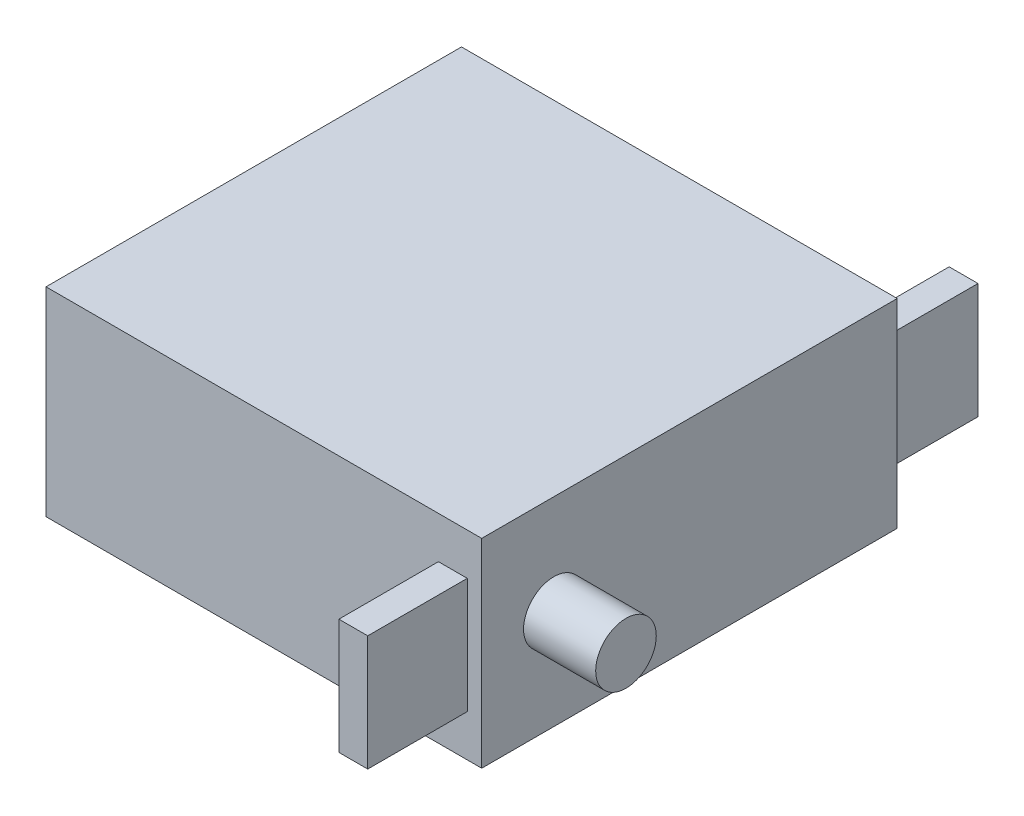
ISO-10303-21;
HEADER;
FILE_DESCRIPTION(('STEP AP214'),'2;1');
FILE_NAME('part.step','',(''),(''),'','','');
FILE_SCHEMA(('AUTOMOTIVE_DESIGN { 1 0 10303 214 1 1 1 1 }'));
ENDSEC;
DATA;
#1=APPLICATION_CONTEXT('core data for automotive mechanical design processes');
#2=APPLICATION_PROTOCOL_DEFINITION('international standard','automotive_design',2000,#1);
#3=PRODUCT_CONTEXT('',#1,'mechanical');
#4=PRODUCT('Part','Part','',(#3));
#5=PRODUCT_RELATED_PRODUCT_CATEGORY('part','',(#4));
#6=PRODUCT_DEFINITION_FORMATION('','',#4);
#7=PRODUCT_DEFINITION_CONTEXT('part definition',#1,'design');
#8=PRODUCT_DEFINITION('design','',#6,#7);
#9=PRODUCT_DEFINITION_SHAPE('','',#8);
#10=(LENGTH_UNIT() NAMED_UNIT(*) SI_UNIT(.MILLI.,.METRE.));
#11=(NAMED_UNIT(*) PLANE_ANGLE_UNIT() SI_UNIT($,.RADIAN.));
#12=(NAMED_UNIT(*) SI_UNIT($,.STERADIAN.) SOLID_ANGLE_UNIT());
#13=UNCERTAINTY_MEASURE_WITH_UNIT(LENGTH_MEASURE(1.E-05),#10,'distance_accuracy_value','');
#14=(GEOMETRIC_REPRESENTATION_CONTEXT(3) GLOBAL_UNCERTAINTY_ASSIGNED_CONTEXT((#13)) GLOBAL_UNIT_ASSIGNED_CONTEXT((#10,
#11,#12)) REPRESENTATION_CONTEXT('',''));
#15=CARTESIAN_POINT('',(0.,0.,0.));
#16=DIRECTION('',(0.,0.,1.));
#17=DIRECTION('',(1.,0.,0.));
#18=AXIS2_PLACEMENT_3D('',#15,#16,#17);
#19=CARTESIAN_POINT('',(0.,6.9,-28.8));
#20=DIRECTION('',(0.,0.,1.));
#21=DIRECTION('',(1.,0.,0.));
#22=AXIS2_PLACEMENT_3D('',#19,#20,#21);
#23=PLANE('',#22);
#24=DIRECTION('',(-1.,0.,0.));
#25=VECTOR('',#24,1.);
#26=CARTESIAN_POINT('',(0.,-6.9,-28.8));
#27=LINE('',#26,#25);
#28=CARTESIAN_POINT('',(30.2,-6.9,-28.8));
#29=VERTEX_POINT('',#28);
#30=CARTESIAN_POINT('',(0.,-6.9,-28.8));
#31=VERTEX_POINT('',#30);
#32=EDGE_CURVE('E189',#29,#31,#27,.T.);
#33=ORIENTED_EDGE('',*,*,#32,.T.);
#34=DIRECTION('',(0.,-1.,0.));
#35=VECTOR('',#34,1.);
#36=CARTESIAN_POINT('',(0.,6.9,-28.8));
#37=LINE('',#36,#35);
#38=CARTESIAN_POINT('',(0.,6.9,-28.8));
#39=VERTEX_POINT('',#38);
#40=EDGE_CURVE('E195',#39,#31,#37,.T.);
#41=ORIENTED_EDGE('',*,*,#40,.F.);
#42=DIRECTION('',(-1.,0.,0.));
#43=VECTOR('',#42,1.);
#44=CARTESIAN_POINT('',(0.,6.9,-28.8));
#45=LINE('',#44,#43);
#46=CARTESIAN_POINT('',(30.2,6.9,-28.8));
#47=VERTEX_POINT('',#46);
#48=EDGE_CURVE('E193',#47,#39,#45,.T.);
#49=ORIENTED_EDGE('',*,*,#48,.F.);
#50=DIRECTION('',(0.,-1.,0.));
#51=VECTOR('',#50,1.);
#52=CARTESIAN_POINT('',(30.2,6.9,-28.8));
#53=LINE('',#52,#51);
#54=EDGE_CURVE('E205',#47,#29,#53,.T.);
#55=ORIENTED_EDGE('',*,*,#54,.T.);
#56=EDGE_LOOP('',(#33,#41,#49,#55));
#57=FACE_BOUND('',#56,.T.);
#58=DIRECTION('',(1.,0.,0.));
#59=VECTOR('',#58,1.);
#60=CARTESIAN_POINT('',(27.2,4.,-28.8));
#61=LINE('',#60,#59);
#62=CARTESIAN_POINT('',(27.2,4.,-28.8));
#63=VERTEX_POINT('',#62);
#64=CARTESIAN_POINT('',(29.2,4.,-28.8));
#65=VERTEX_POINT('',#64);
#66=EDGE_CURVE('E142',#63,#65,#61,.T.);
#67=ORIENTED_EDGE('',*,*,#66,.F.);
#68=DIRECTION('',(0.,1.,0.));
#69=VECTOR('',#68,1.);
#70=CARTESIAN_POINT('',(27.2,-4.,-28.8));
#71=LINE('',#70,#69);
#72=CARTESIAN_POINT('',(27.2,-4.,-28.8));
#73=VERTEX_POINT('',#72);
#74=EDGE_CURVE('E139',#73,#63,#71,.T.);
#75=ORIENTED_EDGE('',*,*,#74,.F.);
#76=DIRECTION('',(-1.,0.,0.));
#77=VECTOR('',#76,1.);
#78=CARTESIAN_POINT('',(29.2,-4.,-28.8));
#79=LINE('',#78,#77);
#80=CARTESIAN_POINT('',(29.2,-4.,-28.8));
#81=VERTEX_POINT('',#80);
#82=EDGE_CURVE('E53',#81,#73,#79,.T.);
#83=ORIENTED_EDGE('',*,*,#82,.F.);
#84=DIRECTION('',(0.,-1.,0.));
#85=VECTOR('',#84,1.);
#86=CARTESIAN_POINT('',(29.2,4.,-28.8));
#87=LINE('',#86,#85);
#88=EDGE_CURVE('E48',#65,#81,#87,.T.);
#89=ORIENTED_EDGE('',*,*,#88,.F.);
#90=EDGE_LOOP('',(#67,#75,#83,#89));
#91=FACE_BOUND('',#90,.T.);
#92=ADVANCED_FACE('F33',(#57,#91),#23,.F.);
#93=CARTESIAN_POINT('',(0.,6.9,0.));
#94=DIRECTION('',(0.,0.,-1.));
#95=DIRECTION('',(-1.,0.,0.));
#96=AXIS2_PLACEMENT_3D('',#93,#94,#95);
#97=PLANE('',#96);
#98=DIRECTION('',(1.,0.,0.));
#99=VECTOR('',#98,1.);
#100=CARTESIAN_POINT('',(0.,-6.9,0.));
#101=LINE('',#100,#99);
#102=CARTESIAN_POINT('',(0.,-6.9,0.));
#103=VERTEX_POINT('',#102);
#104=CARTESIAN_POINT('',(30.2,-6.9,0.));
#105=VERTEX_POINT('',#104);
#106=EDGE_CURVE('E198',#103,#105,#101,.T.);
#107=ORIENTED_EDGE('',*,*,#106,.T.);
#108=DIRECTION('',(0.,-1.,0.));
#109=VECTOR('',#108,1.);
#110=CARTESIAN_POINT('',(30.2,6.9,0.));
#111=LINE('',#110,#109);
#112=CARTESIAN_POINT('',(30.2,6.9,0.));
#113=VERTEX_POINT('',#112);
#114=EDGE_CURVE('E208',#113,#105,#111,.T.);
#115=ORIENTED_EDGE('',*,*,#114,.F.);
#116=DIRECTION('',(1.,0.,0.));
#117=VECTOR('',#116,1.);
#118=CARTESIAN_POINT('',(0.,6.9,0.));
#119=LINE('',#118,#117);
#120=CARTESIAN_POINT('',(0.,6.9,0.));
#121=VERTEX_POINT('',#120);
#122=EDGE_CURVE('E188',#121,#113,#119,.T.);
#123=ORIENTED_EDGE('',*,*,#122,.F.);
#124=DIRECTION('',(0.,-1.,0.));
#125=VECTOR('',#124,1.);
#126=CARTESIAN_POINT('',(0.,6.9,0.));
#127=LINE('',#126,#125);
#128=EDGE_CURVE('E41',#121,#103,#127,.T.);
#129=ORIENTED_EDGE('',*,*,#128,.T.);
#130=EDGE_LOOP('',(#107,#115,#123,#129));
#131=FACE_BOUND('',#130,.T.);
#132=DIRECTION('',(0.,-1.,0.));
#133=VECTOR('',#132,1.);
#134=CARTESIAN_POINT('',(27.2,4.,0.));
#135=LINE('',#134,#133);
#136=CARTESIAN_POINT('',(27.2,4.,0.));
#137=VERTEX_POINT('',#136);
#138=CARTESIAN_POINT('',(27.2,-4.,0.));
#139=VERTEX_POINT('',#138);
#140=EDGE_CURVE('E143',#137,#139,#135,.T.);
#141=ORIENTED_EDGE('',*,*,#140,.F.);
#142=DIRECTION('',(-1.,0.,0.));
#143=VECTOR('',#142,1.);
#144=CARTESIAN_POINT('',(27.2,4.,0.));
#145=LINE('',#144,#143);
#146=CARTESIAN_POINT('',(29.2,4.,0.));
#147=VERTEX_POINT('',#146);
#148=EDGE_CURVE('E156',#147,#137,#145,.T.);
#149=ORIENTED_EDGE('',*,*,#148,.F.);
#150=DIRECTION('',(0.,1.,0.));
#151=VECTOR('',#150,1.);
#152=CARTESIAN_POINT('',(29.2,4.,0.));
#153=LINE('',#152,#151);
#154=CARTESIAN_POINT('',(29.2,-4.,0.));
#155=VERTEX_POINT('',#154);
#156=EDGE_CURVE('E165',#155,#147,#153,.T.);
#157=ORIENTED_EDGE('',*,*,#156,.F.);
#158=DIRECTION('',(1.,0.,0.));
#159=VECTOR('',#158,1.);
#160=CARTESIAN_POINT('',(27.2,-4.,0.));
#161=LINE('',#160,#159);
#162=EDGE_CURVE('E146',#139,#155,#161,.T.);
#163=ORIENTED_EDGE('',*,*,#162,.F.);
#164=EDGE_LOOP('',(#141,#149,#157,#163));
#165=FACE_BOUND('',#164,.T.);
#166=ADVANCED_FACE('F213',(#131,#165),#97,.F.);
#167=CARTESIAN_POINT('',(0.,6.9,0.));
#168=DIRECTION('',(1.,0.,0.));
#169=DIRECTION('',(0.,0.,-1.));
#170=AXIS2_PLACEMENT_3D('',#167,#168,#169);
#171=PLANE('',#170);
#172=DIRECTION('',(0.,0.,1.));
#173=VECTOR('',#172,1.);
#174=CARTESIAN_POINT('',(0.,-6.9,0.));
#175=LINE('',#174,#173);
#176=EDGE_CURVE('E184',#31,#103,#175,.T.);
#177=ORIENTED_EDGE('',*,*,#176,.T.);
#178=ORIENTED_EDGE('',*,*,#128,.F.);
#179=DIRECTION('',(0.,0.,1.));
#180=VECTOR('',#179,1.);
#181=CARTESIAN_POINT('',(0.,6.9,0.));
#182=LINE('',#181,#180);
#183=EDGE_CURVE('E185',#39,#121,#182,.T.);
#184=ORIENTED_EDGE('',*,*,#183,.F.);
#185=ORIENTED_EDGE('',*,*,#40,.T.);
#186=EDGE_LOOP('',(#177,#178,#184,#185));
#187=FACE_BOUND('',#186,.T.);
#188=ADVANCED_FACE('F35',(#187),#171,.F.);
#189=CARTESIAN_POINT('',(30.2,6.9,0.));
#190=DIRECTION('',(-1.,0.,0.));
#191=DIRECTION('',(0.,0.,1.));
#192=AXIS2_PLACEMENT_3D('',#189,#190,#191);
#193=PLANE('',#192);
#194=CARTESIAN_POINT('',(30.2,0.,-5.));
#195=DIRECTION('',(-1.,0.,0.));
#196=DIRECTION('',(0.,0.,1.));
#197=AXIS2_PLACEMENT_3D('',#194,#195,#196);
#198=CIRCLE('',#197,2.1);
#199=CARTESIAN_POINT('',(30.2,0.,-2.9));
#200=VERTEX_POINT('',#199);
#201=EDGE_CURVE('E11',#200,#200,#198,.F.);
#202=ORIENTED_EDGE('',*,*,#201,.F.);
#203=EDGE_LOOP('',(#202));
#204=FACE_BOUND('',#203,.T.);
#205=DIRECTION('',(0.,0.,-1.));
#206=VECTOR('',#205,1.);
#207=CARTESIAN_POINT('',(30.2,-6.9,0.));
#208=LINE('',#207,#206);
#209=EDGE_CURVE('E200',#105,#29,#208,.T.);
#210=ORIENTED_EDGE('',*,*,#209,.T.);
#211=ORIENTED_EDGE('',*,*,#54,.F.);
#212=DIRECTION('',(0.,0.,-1.));
#213=VECTOR('',#212,1.);
#214=CARTESIAN_POINT('',(30.2,6.9,0.));
#215=LINE('',#214,#213);
#216=EDGE_CURVE('E191',#113,#47,#215,.T.);
#217=ORIENTED_EDGE('',*,*,#216,.F.);
#218=ORIENTED_EDGE('',*,*,#114,.T.);
#219=EDGE_LOOP('',(#210,#211,#217,#218));
#220=FACE_BOUND('',#219,.T.);
#221=ADVANCED_FACE('F226',(#204,#220),#193,.F.);
#222=CARTESIAN_POINT('',(0.,6.9,0.));
#223=DIRECTION('',(0.,-1.,0.));
#224=DIRECTION('',(0.,0.,-1.));
#225=AXIS2_PLACEMENT_3D('',#222,#223,#224);
#226=PLANE('',#225);
#227=ORIENTED_EDGE('',*,*,#183,.T.);
#228=ORIENTED_EDGE('',*,*,#122,.T.);
#229=ORIENTED_EDGE('',*,*,#216,.T.);
#230=ORIENTED_EDGE('',*,*,#48,.T.);
#231=EDGE_LOOP('',(#227,#228,#229,#230));
#232=FACE_BOUND('',#231,.T.);
#233=ADVANCED_FACE('F231',(#232),#226,.F.);
#234=CARTESIAN_POINT('',(0.,-6.9,0.));
#235=DIRECTION('',(0.,-1.,0.));
#236=DIRECTION('',(0.,0.,-1.));
#237=AXIS2_PLACEMENT_3D('',#234,#235,#236);
#238=PLANE('',#237);
#239=ORIENTED_EDGE('',*,*,#176,.F.);
#240=ORIENTED_EDGE('',*,*,#32,.F.);
#241=ORIENTED_EDGE('',*,*,#209,.F.);
#242=ORIENTED_EDGE('',*,*,#106,.F.);
#243=EDGE_LOOP('',(#239,#240,#241,#242));
#244=FACE_BOUND('',#243,.T.);
#245=ADVANCED_FACE('F222',(#244),#238,.T.);
#246=CARTESIAN_POINT('',(35.2,0.,-5.));
#247=DIRECTION('',(-1.,0.,0.));
#248=DIRECTION('',(0.,0.,1.));
#249=AXIS2_PLACEMENT_3D('',#246,#247,#248);
#250=CYLINDRICAL_SURFACE('',#249,2.1);
#251=CARTESIAN_POINT('',(35.2,0.,-5.));
#252=DIRECTION('',(1.,0.,0.));
#253=DIRECTION('',(0.,0.,-1.));
#254=AXIS2_PLACEMENT_3D('',#251,#252,#253);
#255=CIRCLE('',#254,2.1);
#256=CARTESIAN_POINT('',(35.2,0.,-7.1));
#257=VERTEX_POINT('',#256);
#258=EDGE_CURVE('E181',#257,#257,#255,.T.);
#259=ORIENTED_EDGE('',*,*,#258,.F.);
#260=EDGE_LOOP('',(#259));
#261=FACE_BOUND('',#260,.T.);
#262=ORIENTED_EDGE('',*,*,#201,.T.);
#263=EDGE_LOOP('',(#262));
#264=FACE_BOUND('',#263,.T.);
#265=ADVANCED_FACE('F238',(#261,#264),#250,.T.);
#266=CARTESIAN_POINT('',(35.2,0.,-5.));
#267=DIRECTION('',(1.,0.,0.));
#268=DIRECTION('',(0.,0.,-1.));
#269=AXIS2_PLACEMENT_3D('',#266,#267,#268);
#270=PLANE('',#269);
#271=ORIENTED_EDGE('',*,*,#258,.T.);
#272=EDGE_LOOP('',(#271));
#273=FACE_BOUND('',#272,.T.);
#274=ADVANCED_FACE('F270',(#273),#270,.T.);
#275=CARTESIAN_POINT('',(27.2,4.,6.9));
#276=DIRECTION('',(1.,0.,0.));
#277=DIRECTION('',(0.,0.,-1.));
#278=AXIS2_PLACEMENT_3D('',#275,#276,#277);
#279=PLANE('',#278);
#280=ORIENTED_EDGE('',*,*,#140,.T.);
#281=DIRECTION('',(0.,0.,-1.));
#282=VECTOR('',#281,1.);
#283=CARTESIAN_POINT('',(27.2,-4.,6.9));
#284=LINE('',#283,#282);
#285=CARTESIAN_POINT('',(27.2,-4.,6.9));
#286=VERTEX_POINT('',#285);
#287=EDGE_CURVE('E178',#286,#139,#284,.T.);
#288=ORIENTED_EDGE('',*,*,#287,.F.);
#289=DIRECTION('',(0.,-1.,0.));
#290=VECTOR('',#289,1.);
#291=CARTESIAN_POINT('',(27.2,4.,6.9));
#292=LINE('',#291,#290);
#293=CARTESIAN_POINT('',(27.2,4.,6.9));
#294=VERTEX_POINT('',#293);
#295=EDGE_CURVE('E152',#294,#286,#292,.T.);
#296=ORIENTED_EDGE('',*,*,#295,.F.);
#297=DIRECTION('',(0.,0.,-1.));
#298=VECTOR('',#297,1.);
#299=CARTESIAN_POINT('',(27.2,4.,6.9));
#300=LINE('',#299,#298);
#301=EDGE_CURVE('E161',#294,#137,#300,.T.);
#302=ORIENTED_EDGE('',*,*,#301,.T.);
#303=EDGE_LOOP('',(#280,#288,#296,#302));
#304=FACE_BOUND('',#303,.T.);
#305=ADVANCED_FACE('F278',(#304),#279,.F.);
#306=CARTESIAN_POINT('',(27.2,-4.,6.9));
#307=DIRECTION('',(0.,1.,0.));
#308=DIRECTION('',(0.,0.,1.));
#309=AXIS2_PLACEMENT_3D('',#306,#307,#308);
#310=PLANE('',#309);
#311=ORIENTED_EDGE('',*,*,#162,.T.);
#312=DIRECTION('',(0.,0.,-1.));
#313=VECTOR('',#312,1.);
#314=CARTESIAN_POINT('',(29.2,-4.,6.9));
#315=LINE('',#314,#313);
#316=CARTESIAN_POINT('',(29.2,-4.,6.9));
#317=VERTEX_POINT('',#316);
#318=EDGE_CURVE('E175',#317,#155,#315,.T.);
#319=ORIENTED_EDGE('',*,*,#318,.F.);
#320=DIRECTION('',(1.,0.,0.));
#321=VECTOR('',#320,1.);
#322=CARTESIAN_POINT('',(27.2,-4.,6.9));
#323=LINE('',#322,#321);
#324=EDGE_CURVE('E155',#286,#317,#323,.T.);
#325=ORIENTED_EDGE('',*,*,#324,.F.);
#326=ORIENTED_EDGE('',*,*,#287,.T.);
#327=EDGE_LOOP('',(#311,#319,#325,#326));
#328=FACE_BOUND('',#327,.T.);
#329=ADVANCED_FACE('F293',(#328),#310,.F.);
#330=CARTESIAN_POINT('',(29.2,4.,6.9));
#331=DIRECTION('',(-1.,0.,0.));
#332=DIRECTION('',(0.,0.,1.));
#333=AXIS2_PLACEMENT_3D('',#330,#331,#332);
#334=PLANE('',#333);
#335=ORIENTED_EDGE('',*,*,#156,.T.);
#336=DIRECTION('',(0.,0.,-1.));
#337=VECTOR('',#336,1.);
#338=CARTESIAN_POINT('',(29.2,4.,6.9));
#339=LINE('',#338,#337);
#340=CARTESIAN_POINT('',(29.2,4.,6.9));
#341=VERTEX_POINT('',#340);
#342=EDGE_CURVE('E172',#341,#147,#339,.T.);
#343=ORIENTED_EDGE('',*,*,#342,.F.);
#344=DIRECTION('',(0.,1.,0.));
#345=VECTOR('',#344,1.);
#346=CARTESIAN_POINT('',(29.2,4.,6.9));
#347=LINE('',#346,#345);
#348=EDGE_CURVE('E158',#317,#341,#347,.T.);
#349=ORIENTED_EDGE('',*,*,#348,.F.);
#350=ORIENTED_EDGE('',*,*,#318,.T.);
#351=EDGE_LOOP('',(#335,#343,#349,#350));
#352=FACE_BOUND('',#351,.T.);
#353=ADVANCED_FACE('F303',(#352),#334,.F.);
#354=CARTESIAN_POINT('',(27.2,4.,6.9));
#355=DIRECTION('',(0.,-1.,0.));
#356=DIRECTION('',(0.,0.,-1.));
#357=AXIS2_PLACEMENT_3D('',#354,#355,#356);
#358=PLANE('',#357);
#359=ORIENTED_EDGE('',*,*,#148,.T.);
#360=ORIENTED_EDGE('',*,*,#301,.F.);
#361=DIRECTION('',(-1.,0.,0.));
#362=VECTOR('',#361,1.);
#363=CARTESIAN_POINT('',(27.2,4.,6.9));
#364=LINE('',#363,#362);
#365=EDGE_CURVE('E160',#341,#294,#364,.T.);
#366=ORIENTED_EDGE('',*,*,#365,.F.);
#367=ORIENTED_EDGE('',*,*,#342,.T.);
#368=EDGE_LOOP('',(#359,#360,#366,#367));
#369=FACE_BOUND('',#368,.T.);
#370=ADVANCED_FACE('F313',(#369),#358,.F.);
#371=CARTESIAN_POINT('',(0.,0.,6.9));
#372=DIRECTION('',(0.,0.,1.));
#373=DIRECTION('',(1.,0.,0.));
#374=AXIS2_PLACEMENT_3D('',#371,#372,#373);
#375=PLANE('',#374);
#376=ORIENTED_EDGE('',*,*,#295,.T.);
#377=ORIENTED_EDGE('',*,*,#324,.T.);
#378=ORIENTED_EDGE('',*,*,#348,.T.);
#379=ORIENTED_EDGE('',*,*,#365,.T.);
#380=EDGE_LOOP('',(#376,#377,#378,#379));
#381=FACE_BOUND('',#380,.T.);
#382=ADVANCED_FACE('F323',(#381),#375,.T.);
#383=CARTESIAN_POINT('',(27.2,4.,-35.4));
#384=DIRECTION('',(0.,-1.,0.));
#385=DIRECTION('',(0.,0.,-1.));
#386=AXIS2_PLACEMENT_3D('',#383,#384,#385);
#387=PLANE('',#386);
#388=ORIENTED_EDGE('',*,*,#66,.T.);
#389=DIRECTION('',(0.,0.,1.));
#390=VECTOR('',#389,1.);
#391=CARTESIAN_POINT('',(29.2,4.,-35.4));
#392=LINE('',#391,#390);
#393=CARTESIAN_POINT('',(29.2,4.,-35.4));
#394=VERTEX_POINT('',#393);
#395=EDGE_CURVE('E123',#394,#65,#392,.T.);
#396=ORIENTED_EDGE('',*,*,#395,.F.);
#397=DIRECTION('',(1.,0.,0.));
#398=VECTOR('',#397,1.);
#399=CARTESIAN_POINT('',(27.2,4.,-35.4));
#400=LINE('',#399,#398);
#401=CARTESIAN_POINT('',(27.2,4.,-35.4));
#402=VERTEX_POINT('',#401);
#403=EDGE_CURVE('E130',#402,#394,#400,.T.);
#404=ORIENTED_EDGE('',*,*,#403,.F.);
#405=DIRECTION('',(0.,0.,1.));
#406=VECTOR('',#405,1.);
#407=CARTESIAN_POINT('',(27.2,4.,-35.4));
#408=LINE('',#407,#406);
#409=EDGE_CURVE('E387',#402,#63,#408,.T.);
#410=ORIENTED_EDGE('',*,*,#409,.T.);
#411=EDGE_LOOP('',(#388,#396,#404,#410));
#412=FACE_BOUND('',#411,.T.);
#413=ADVANCED_FACE('F141',(#412),#387,.F.);
#414=CARTESIAN_POINT('',(29.2,4.,-35.4));
#415=DIRECTION('',(-1.,0.,0.));
#416=DIRECTION('',(0.,0.,1.));
#417=AXIS2_PLACEMENT_3D('',#414,#415,#416);
#418=PLANE('',#417);
#419=ORIENTED_EDGE('',*,*,#88,.T.);
#420=DIRECTION('',(0.,0.,1.));
#421=VECTOR('',#420,1.);
#422=CARTESIAN_POINT('',(29.2,-4.,-35.4));
#423=LINE('',#422,#421);
#424=CARTESIAN_POINT('',(29.2,-4.,-35.4));
#425=VERTEX_POINT('',#424);
#426=EDGE_CURVE('E126',#425,#81,#423,.T.);
#427=ORIENTED_EDGE('',*,*,#426,.F.);
#428=DIRECTION('',(0.,-1.,0.));
#429=VECTOR('',#428,1.);
#430=CARTESIAN_POINT('',(29.2,4.,-35.4));
#431=LINE('',#430,#429);
#432=EDGE_CURVE('E119',#394,#425,#431,.T.);
#433=ORIENTED_EDGE('',*,*,#432,.F.);
#434=ORIENTED_EDGE('',*,*,#395,.T.);
#435=EDGE_LOOP('',(#419,#427,#433,#434));
#436=FACE_BOUND('',#435,.T.);
#437=ADVANCED_FACE('F121',(#436),#418,.F.);
#438=CARTESIAN_POINT('',(29.2,-4.,-35.4));
#439=DIRECTION('',(0.,1.,0.));
#440=DIRECTION('',(0.,0.,1.));
#441=AXIS2_PLACEMENT_3D('',#438,#439,#440);
#442=PLANE('',#441);
#443=ORIENTED_EDGE('',*,*,#82,.T.);
#444=DIRECTION('',(0.,0.,1.));
#445=VECTOR('',#444,1.);
#446=CARTESIAN_POINT('',(27.2,-4.,-35.4));
#447=LINE('',#446,#445);
#448=CARTESIAN_POINT('',(27.2,-4.,-35.4));
#449=VERTEX_POINT('',#448);
#450=EDGE_CURVE('E148',#449,#73,#447,.T.);
#451=ORIENTED_EDGE('',*,*,#450,.F.);
#452=DIRECTION('',(-1.,0.,0.));
#453=VECTOR('',#452,1.);
#454=CARTESIAN_POINT('',(29.2,-4.,-35.4));
#455=LINE('',#454,#453);
#456=EDGE_CURVE('E129',#425,#449,#455,.T.);
#457=ORIENTED_EDGE('',*,*,#456,.F.);
#458=ORIENTED_EDGE('',*,*,#426,.T.);
#459=EDGE_LOOP('',(#443,#451,#457,#458));
#460=FACE_BOUND('',#459,.T.);
#461=ADVANCED_FACE('F354',(#460),#442,.F.);
#462=CARTESIAN_POINT('',(27.2,-4.,-35.4));
#463=DIRECTION('',(1.,0.,0.));
#464=DIRECTION('',(0.,0.,-1.));
#465=AXIS2_PLACEMENT_3D('',#462,#463,#464);
#466=PLANE('',#465);
#467=ORIENTED_EDGE('',*,*,#74,.T.);
#468=ORIENTED_EDGE('',*,*,#409,.F.);
#469=DIRECTION('',(0.,1.,0.));
#470=VECTOR('',#469,1.);
#471=CARTESIAN_POINT('',(27.2,-4.,-35.4));
#472=LINE('',#471,#470);
#473=EDGE_CURVE('E135',#449,#402,#472,.T.);
#474=ORIENTED_EDGE('',*,*,#473,.F.);
#475=ORIENTED_EDGE('',*,*,#450,.T.);
#476=EDGE_LOOP('',(#467,#468,#474,#475));
#477=FACE_BOUND('',#476,.T.);
#478=ADVANCED_FACE('F363',(#477),#466,.F.);
#479=CARTESIAN_POINT('',(0.,0.,-35.4));
#480=DIRECTION('',(0.,0.,-1.));
#481=DIRECTION('',(-1.,0.,0.));
#482=AXIS2_PLACEMENT_3D('',#479,#480,#481);
#483=PLANE('',#482);
#484=ORIENTED_EDGE('',*,*,#403,.T.);
#485=ORIENTED_EDGE('',*,*,#432,.T.);
#486=ORIENTED_EDGE('',*,*,#456,.T.);
#487=ORIENTED_EDGE('',*,*,#473,.T.);
#488=EDGE_LOOP('',(#484,#485,#486,#487));
#489=FACE_BOUND('',#488,.T.);
#490=ADVANCED_FACE('F133',(#489),#483,.T.);
#491=CLOSED_SHELL('',(#92,#166,#188,#221,#233,#245,#265,#274,#305,#329,#353,#370,#382,#413,#437,
#461,#478,#490));
#492=MANIFOLD_SOLID_BREP('B2',#491);
#493=ADVANCED_BREP_SHAPE_REPRESENTATION('',(#18,#492),#14);
#494=SHAPE_DEFINITION_REPRESENTATION(#9,#493);
ENDSEC;
END-ISO-10303-21;
